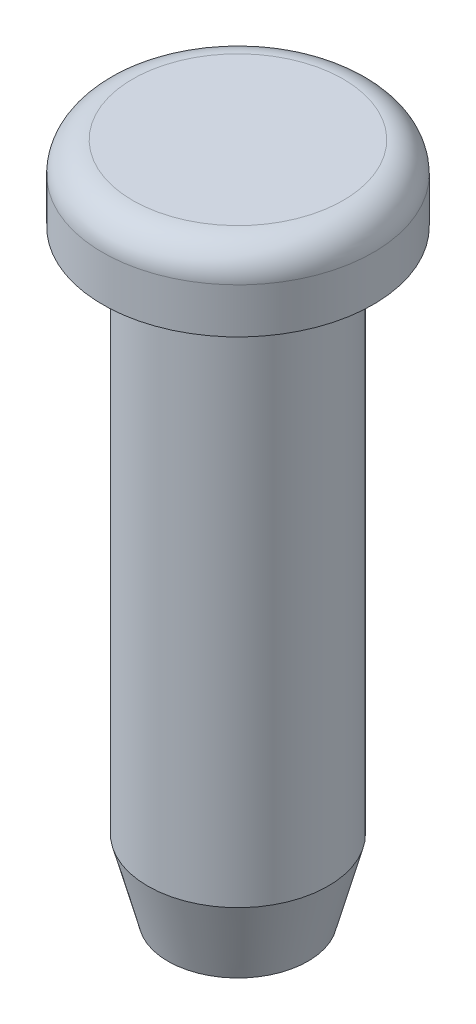
ISO-10303-21;
HEADER;
FILE_DESCRIPTION(('STEP AP214'),'2;1');
FILE_NAME('part.step','',(''),(''),'','','');
FILE_SCHEMA(('AUTOMOTIVE_DESIGN { 1 0 10303 214 1 1 1 1 }'));
ENDSEC;
DATA;
#1=APPLICATION_CONTEXT('core data for automotive mechanical design processes');
#2=APPLICATION_PROTOCOL_DEFINITION('international standard','automotive_design',2000,#1);
#3=PRODUCT_CONTEXT('',#1,'mechanical');
#4=PRODUCT('Part','Part','',(#3));
#5=PRODUCT_RELATED_PRODUCT_CATEGORY('part','',(#4));
#6=PRODUCT_DEFINITION_FORMATION('','',#4);
#7=PRODUCT_DEFINITION_CONTEXT('part definition',#1,'design');
#8=PRODUCT_DEFINITION('design','',#6,#7);
#9=PRODUCT_DEFINITION_SHAPE('','',#8);
#10=(LENGTH_UNIT() NAMED_UNIT(*) SI_UNIT(.MILLI.,.METRE.));
#11=(NAMED_UNIT(*) PLANE_ANGLE_UNIT() SI_UNIT($,.RADIAN.));
#12=(NAMED_UNIT(*) SI_UNIT($,.STERADIAN.) SOLID_ANGLE_UNIT());
#13=UNCERTAINTY_MEASURE_WITH_UNIT(LENGTH_MEASURE(1.E-05),#10,'distance_accuracy_value','');
#14=(GEOMETRIC_REPRESENTATION_CONTEXT(3) GLOBAL_UNCERTAINTY_ASSIGNED_CONTEXT((#13)) GLOBAL_UNIT_ASSIGNED_CONTEXT((#10,
#11,#12)) REPRESENTATION_CONTEXT('',''));
#15=CARTESIAN_POINT('',(0.,0.,0.));
#16=DIRECTION('',(0.,0.,1.));
#17=DIRECTION('',(1.,0.,0.));
#18=AXIS2_PLACEMENT_3D('',#15,#16,#17);
#19=CARTESIAN_POINT('',(0.,5.08,0.));
#20=DIRECTION('',(0.,-1.,0.));
#21=DIRECTION('',(0.,0.,-1.));
#22=AXIS2_PLACEMENT_3D('',#19,#20,#21);
#23=CYLINDRICAL_SURFACE('',#22,1.524);
#24=CARTESIAN_POINT('',(0.,-3.80999999999999,0.));
#25=DIRECTION('',(0.,1.,0.));
#26=DIRECTION('',(0.,0.,1.));
#27=AXIS2_PLACEMENT_3D('',#24,#25,#26);
#28=CIRCLE('',#27,1.524);
#29=CARTESIAN_POINT('',(0.,-3.80999999999999,1.524));
#30=VERTEX_POINT('',#29);
#31=EDGE_CURVE('E39',#30,#30,#28,.T.);
#32=ORIENTED_EDGE('',*,*,#31,.T.);
#33=EDGE_LOOP('',(#32));
#34=FACE_BOUND('',#33,.T.);
#35=CARTESIAN_POINT('',(0.,5.08,0.));
#36=DIRECTION('',(0.,1.,0.));
#37=DIRECTION('',(0.,0.,1.));
#38=AXIS2_PLACEMENT_3D('',#35,#36,#37);
#39=CIRCLE('',#38,1.524);
#40=CARTESIAN_POINT('',(0.,5.08,1.524));
#41=VERTEX_POINT('',#40);
#42=EDGE_CURVE('E43',#41,#41,#39,.T.);
#43=ORIENTED_EDGE('',*,*,#42,.F.);
#44=EDGE_LOOP('',(#43));
#45=FACE_BOUND('',#44,.T.);
#46=ADVANCED_FACE('F32',(#34,#45),#23,.T.);
#47=CARTESIAN_POINT('',(0.,-5.08,0.));
#48=DIRECTION('',(0.,1.,0.));
#49=DIRECTION('',(0.,0.,1.));
#50=AXIS2_PLACEMENT_3D('',#47,#48,#49);
#51=PLANE('',#50);
#52=CARTESIAN_POINT('',(0.,-5.08,0.));
#53=DIRECTION('',(0.,1.,0.));
#54=DIRECTION('',(0.,0.,1.));
#55=AXIS2_PLACEMENT_3D('',#52,#53,#54);
#56=CIRCLE('',#55,1.18370452561247);
#57=CARTESIAN_POINT('',(0.,-5.08,1.18370452561247));
#58=VERTEX_POINT('',#57);
#59=EDGE_CURVE('E10',#58,#58,#56,.F.);
#60=ORIENTED_EDGE('',*,*,#59,.T.);
#61=EDGE_LOOP('',(#60));
#62=FACE_BOUND('',#61,.T.);
#63=ADVANCED_FACE('F76',(#62),#51,.F.);
#64=CARTESIAN_POINT('',(0.,-3.80999999999999,0.));
#65=DIRECTION('',(0.,1.,0.));
#66=DIRECTION('',(0.,0.,1.));
#67=AXIS2_PLACEMENT_3D('',#64,#65,#66);
#68=CONICAL_SURFACE('',#67,1.524,0.261799387799147);
#69=ORIENTED_EDGE('',*,*,#59,.F.);
#70=EDGE_LOOP('',(#69));
#71=FACE_BOUND('',#70,.T.);
#72=ORIENTED_EDGE('',*,*,#31,.F.);
#73=EDGE_LOOP('',(#72));
#74=FACE_BOUND('',#73,.T.);
#75=ADVANCED_FACE('F34',(#71,#74),#68,.T.);
#76=CARTESIAN_POINT('',(0.,6.35,0.));
#77=DIRECTION('',(0.,1.,0.));
#78=DIRECTION('',(0.,0.,1.));
#79=AXIS2_PLACEMENT_3D('',#76,#77,#78);
#80=PLANE('',#79);
#81=CARTESIAN_POINT('',(0.,6.35,0.));
#82=DIRECTION('',(0.,-1.,0.));
#83=DIRECTION('',(0.,0.,-1.));
#84=AXIS2_PLACEMENT_3D('',#81,#82,#83);
#85=CIRCLE('',#84,1.778);
#86=CARTESIAN_POINT('',(0.,6.35,-1.778));
#87=VERTEX_POINT('',#86);
#88=EDGE_CURVE('E47',#87,#87,#85,.T.);
#89=ORIENTED_EDGE('',*,*,#88,.F.);
#90=EDGE_LOOP('',(#89));
#91=FACE_BOUND('',#90,.T.);
#92=ADVANCED_FACE('F72',(#91),#80,.T.);
#93=CARTESIAN_POINT('',(0.,5.842,0.));
#94=DIRECTION('',(0.,-1.,0.));
#95=DIRECTION('',(0.,0.,-1.));
#96=AXIS2_PLACEMENT_3D('',#93,#94,#95);
#97=TOROIDAL_SURFACE('',#96,1.778,0.508);
#98=ORIENTED_EDGE('',*,*,#88,.T.);
#99=EDGE_LOOP('',(#98));
#100=FACE_BOUND('',#99,.T.);
#101=CARTESIAN_POINT('',(0.,5.842,0.));
#102=DIRECTION('',(0.,-1.,0.));
#103=DIRECTION('',(0.,0.,-1.));
#104=AXIS2_PLACEMENT_3D('',#101,#102,#103);
#105=CIRCLE('',#104,2.286);
#106=CARTESIAN_POINT('',(0.,5.842,-2.286));
#107=VERTEX_POINT('',#106);
#108=EDGE_CURVE('E52',#107,#107,#105,.T.);
#109=ORIENTED_EDGE('',*,*,#108,.F.);
#110=EDGE_LOOP('',(#109));
#111=FACE_BOUND('',#110,.T.);
#112=ADVANCED_FACE('F63',(#100,#111),#97,.T.);
#113=CARTESIAN_POINT('',(0.,5.08,0.));
#114=DIRECTION('',(0.,-1.,0.));
#115=DIRECTION('',(0.,0.,-1.));
#116=AXIS2_PLACEMENT_3D('',#113,#114,#115);
#117=CYLINDRICAL_SURFACE('',#116,2.286);
#118=ORIENTED_EDGE('',*,*,#108,.T.);
#119=EDGE_LOOP('',(#118));
#120=FACE_BOUND('',#119,.T.);
#121=CARTESIAN_POINT('',(0.,5.08,0.));
#122=DIRECTION('',(0.,-1.,0.));
#123=DIRECTION('',(0.,0.,-1.));
#124=AXIS2_PLACEMENT_3D('',#121,#122,#123);
#125=CIRCLE('',#124,2.286);
#126=CARTESIAN_POINT('',(0.,5.08,-2.286));
#127=VERTEX_POINT('',#126);
#128=EDGE_CURVE('E55',#127,#127,#125,.T.);
#129=ORIENTED_EDGE('',*,*,#128,.F.);
#130=EDGE_LOOP('',(#129));
#131=FACE_BOUND('',#130,.T.);
#132=ADVANCED_FACE('F61',(#120,#131),#117,.T.);
#133=CARTESIAN_POINT('',(0.,5.08,0.));
#134=DIRECTION('',(0.,-1.,0.));
#135=DIRECTION('',(0.,0.,-1.));
#136=AXIS2_PLACEMENT_3D('',#133,#134,#135);
#137=PLANE('',#136);
#138=ORIENTED_EDGE('',*,*,#42,.T.);
#139=EDGE_LOOP('',(#138));
#140=FACE_BOUND('',#139,.T.);
#141=ORIENTED_EDGE('',*,*,#128,.T.);
#142=EDGE_LOOP('',(#141));
#143=FACE_BOUND('',#142,.T.);
#144=ADVANCED_FACE('F59',(#140,#143),#137,.T.);
#145=CLOSED_SHELL('',(#46,#63,#75,#92,#112,#132,#144));
#146=MANIFOLD_SOLID_BREP('B2',#145);
#147=ADVANCED_BREP_SHAPE_REPRESENTATION('',(#18,#146),#14);
#148=SHAPE_DEFINITION_REPRESENTATION(#9,#147);
ENDSEC;
END-ISO-10303-21;
